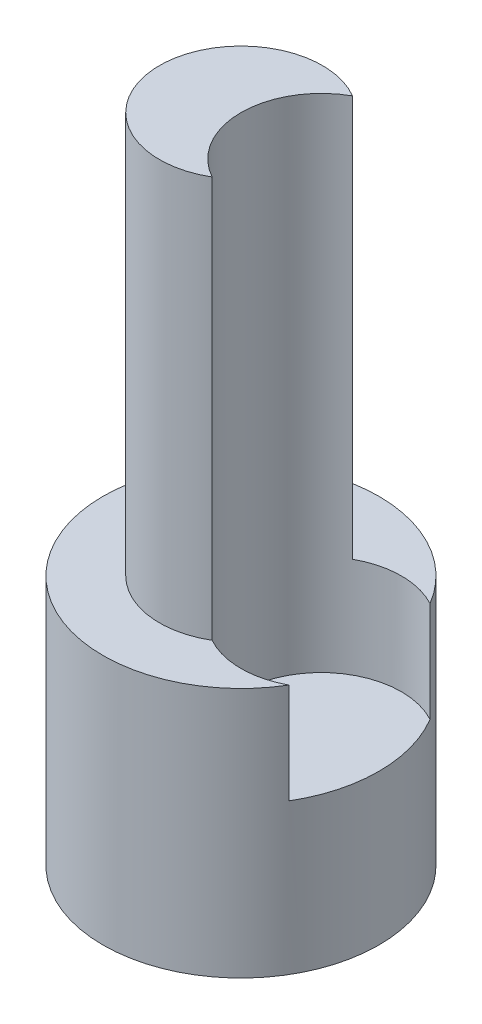
ISO-10303-21;
HEADER;
FILE_DESCRIPTION(('STEP AP214'),'2;1');
FILE_NAME('part.step','',(''),(''),'','','');
FILE_SCHEMA(('AUTOMOTIVE_DESIGN { 1 0 10303 214 1 1 1 1 }'));
ENDSEC;
DATA;
#1=APPLICATION_CONTEXT('core data for automotive mechanical design processes');
#2=APPLICATION_PROTOCOL_DEFINITION('international standard','automotive_design',2000,#1);
#3=PRODUCT_CONTEXT('',#1,'mechanical');
#4=PRODUCT('Part','Part','',(#3));
#5=PRODUCT_RELATED_PRODUCT_CATEGORY('part','',(#4));
#6=PRODUCT_DEFINITION_FORMATION('','',#4);
#7=PRODUCT_DEFINITION_CONTEXT('part definition',#1,'design');
#8=PRODUCT_DEFINITION('design','',#6,#7);
#9=PRODUCT_DEFINITION_SHAPE('','',#8);
#10=(LENGTH_UNIT() NAMED_UNIT(*) SI_UNIT(.MILLI.,.METRE.));
#11=(NAMED_UNIT(*) PLANE_ANGLE_UNIT() SI_UNIT($,.RADIAN.));
#12=(NAMED_UNIT(*) SI_UNIT($,.STERADIAN.) SOLID_ANGLE_UNIT());
#13=UNCERTAINTY_MEASURE_WITH_UNIT(LENGTH_MEASURE(1.E-05),#10,'distance_accuracy_value','');
#14=(GEOMETRIC_REPRESENTATION_CONTEXT(3) GLOBAL_UNCERTAINTY_ASSIGNED_CONTEXT((#13)) GLOBAL_UNIT_ASSIGNED_CONTEXT((#10,
#11,#12)) REPRESENTATION_CONTEXT('',''));
#15=CARTESIAN_POINT('',(0.,0.,0.));
#16=DIRECTION('',(0.,0.,1.));
#17=DIRECTION('',(1.,0.,0.));
#18=AXIS2_PLACEMENT_3D('',#15,#16,#17);
#19=CARTESIAN_POINT('',(0.,5.,0.));
#20=DIRECTION('',(0.,-1.,0.));
#21=DIRECTION('',(0.,0.,-1.));
#22=AXIS2_PLACEMENT_3D('',#19,#20,#21);
#23=CYLINDRICAL_SURFACE('',#22,2.75);
#24=CARTESIAN_POINT('',(0.,3.,0.));
#25=DIRECTION('',(0.,1.,0.));
#26=DIRECTION('',(0.,0.,1.));
#27=AXIS2_PLACEMENT_3D('',#24,#25,#26);
#28=CIRCLE('',#27,2.75);
#29=CARTESIAN_POINT('',(2.36328125,3.,1.40620117102726));
#30=VERTEX_POINT('',#29);
#31=CARTESIAN_POINT('',(2.36328125,3.,-1.40620117102726));
#32=VERTEX_POINT('',#31);
#33=EDGE_CURVE('E84',#30,#32,#28,.T.);
#34=ORIENTED_EDGE('',*,*,#33,.F.);
#35=DIRECTION('',(0.,1.,0.));
#36=VECTOR('',#35,1.);
#37=CARTESIAN_POINT('',(2.36328125,3.,1.40620117102726));
#38=LINE('',#37,#36);
#39=CARTESIAN_POINT('',(2.36328125,5.,1.40620117102726));
#40=VERTEX_POINT('',#39);
#41=EDGE_CURVE('E73',#30,#40,#38,.T.);
#42=ORIENTED_EDGE('',*,*,#41,.T.);
#43=CARTESIAN_POINT('',(0.,5.,0.));
#44=DIRECTION('',(0.,1.,0.));
#45=DIRECTION('',(0.,0.,1.));
#46=AXIS2_PLACEMENT_3D('',#43,#44,#45);
#47=CIRCLE('',#46,2.75);
#48=CARTESIAN_POINT('',(2.36328125,5.,-1.40620117102726));
#49=VERTEX_POINT('',#48);
#50=EDGE_CURVE('E44',#49,#40,#47,.T.);
#51=ORIENTED_EDGE('',*,*,#50,.F.);
#52=DIRECTION('',(0.,1.,0.));
#53=VECTOR('',#52,1.);
#54=CARTESIAN_POINT('',(2.36328125,3.,-1.40620117102726));
#55=LINE('',#54,#53);
#56=EDGE_CURVE('E83',#32,#49,#55,.T.);
#57=ORIENTED_EDGE('',*,*,#56,.F.);
#58=EDGE_LOOP('',(#34,#42,#51,#57));
#59=FACE_BOUND('',#58,.T.);
#60=CARTESIAN_POINT('',(0.,0.,0.));
#61=DIRECTION('',(0.,1.,0.));
#62=DIRECTION('',(0.,0.,1.));
#63=AXIS2_PLACEMENT_3D('',#60,#61,#62);
#64=CIRCLE('',#63,2.75);
#65=CARTESIAN_POINT('',(0.,0.,2.75));
#66=VERTEX_POINT('',#65);
#67=EDGE_CURVE('E101',#66,#66,#64,.T.);
#68=ORIENTED_EDGE('',*,*,#67,.T.);
#69=EDGE_LOOP('',(#68));
#70=FACE_BOUND('',#69,.T.);
#71=ADVANCED_FACE('F37',(#59,#70),#23,.T.);
#72=CARTESIAN_POINT('',(0.,5.,0.));
#73=DIRECTION('',(0.,1.,0.));
#74=DIRECTION('',(0.,0.,1.));
#75=AXIS2_PLACEMENT_3D('',#72,#73,#74);
#76=PLANE('',#75);
#77=CARTESIAN_POINT('',(1.6,5.,0.));
#78=DIRECTION('',(0.,1.,0.));
#79=DIRECTION('',(0.,0.,1.));
#80=AXIS2_PLACEMENT_3D('',#77,#78,#79);
#81=CIRCLE('',#80,1.6);
#82=CARTESIAN_POINT('',(0.8251953125,5.,-1.39988488677749));
#83=VERTEX_POINT('',#82);
#84=EDGE_CURVE('E95',#49,#83,#81,.T.);
#85=ORIENTED_EDGE('',*,*,#84,.F.);
#86=ORIENTED_EDGE('',*,*,#50,.T.);
#87=CARTESIAN_POINT('',(0.8251953125,5.,1.39988488677749));
#88=VERTEX_POINT('',#87);
#89=EDGE_CURVE('E78',#88,#40,#81,.T.);
#90=ORIENTED_EDGE('',*,*,#89,.F.);
#91=CARTESIAN_POINT('',(0.,5.,0.));
#92=DIRECTION('',(0.,1.,0.));
#93=DIRECTION('',(0.,0.,1.));
#94=AXIS2_PLACEMENT_3D('',#91,#92,#93);
#95=CIRCLE('',#94,1.625);
#96=EDGE_CURVE('E102',#83,#88,#95,.T.);
#97=ORIENTED_EDGE('',*,*,#96,.F.);
#98=EDGE_LOOP('',(#85,#86,#90,#97));
#99=FACE_BOUND('',#98,.T.);
#100=ADVANCED_FACE('F111',(#99),#76,.T.);
#101=CARTESIAN_POINT('',(0.,0.,0.));
#102=DIRECTION('',(0.,1.,0.));
#103=DIRECTION('',(0.,0.,1.));
#104=AXIS2_PLACEMENT_3D('',#101,#102,#103);
#105=PLANE('',#104);
#106=ORIENTED_EDGE('',*,*,#67,.F.);
#107=EDGE_LOOP('',(#106));
#108=FACE_BOUND('',#107,.T.);
#109=ADVANCED_FACE('F108',(#108),#105,.F.);
#110=CARTESIAN_POINT('',(0.,13.,0.));
#111=DIRECTION('',(0.,-1.,0.));
#112=DIRECTION('',(0.,0.,-1.));
#113=AXIS2_PLACEMENT_3D('',#110,#111,#112);
#114=CYLINDRICAL_SURFACE('',#113,1.625);
#115=ORIENTED_EDGE('',*,*,#96,.T.);
#116=DIRECTION('',(0.,1.,0.));
#117=VECTOR('',#116,1.);
#118=CARTESIAN_POINT('',(0.8251953125,8.,1.39988488677749));
#119=LINE('',#118,#117);
#120=CARTESIAN_POINT('',(0.8251953125,13.,1.39988488677749));
#121=VERTEX_POINT('',#120);
#122=EDGE_CURVE('E56',#88,#121,#119,.T.);
#123=ORIENTED_EDGE('',*,*,#122,.T.);
#124=CARTESIAN_POINT('',(0.,13.,0.));
#125=DIRECTION('',(0.,1.,0.));
#126=DIRECTION('',(0.,0.,1.));
#127=AXIS2_PLACEMENT_3D('',#124,#125,#126);
#128=CIRCLE('',#127,1.625);
#129=CARTESIAN_POINT('',(0.8251953125,13.,-1.39988488677749));
#130=VERTEX_POINT('',#129);
#131=EDGE_CURVE('E98',#130,#121,#128,.T.);
#132=ORIENTED_EDGE('',*,*,#131,.F.);
#133=DIRECTION('',(0.,1.,0.));
#134=VECTOR('',#133,1.);
#135=CARTESIAN_POINT('',(0.8251953125,8.,-1.39988488677749));
#136=LINE('',#135,#134);
#137=EDGE_CURVE('E50',#130,#83,#136,.F.);
#138=ORIENTED_EDGE('',*,*,#137,.T.);
#139=EDGE_LOOP('',(#115,#123,#132,#138));
#140=FACE_BOUND('',#139,.T.);
#141=ADVANCED_FACE('F110',(#140),#114,.T.);
#142=CARTESIAN_POINT('',(0.,13.,0.));
#143=DIRECTION('',(0.,1.,0.));
#144=DIRECTION('',(0.,0.,1.));
#145=AXIS2_PLACEMENT_3D('',#142,#143,#144);
#146=PLANE('',#145);
#147=CARTESIAN_POINT('',(1.6,13.,0.));
#148=DIRECTION('',(0.,1.,0.));
#149=DIRECTION('',(0.,0.,1.));
#150=AXIS2_PLACEMENT_3D('',#147,#148,#149);
#151=CIRCLE('',#150,1.6);
#152=EDGE_CURVE('E11',#130,#121,#151,.T.);
#153=ORIENTED_EDGE('',*,*,#152,.F.);
#154=ORIENTED_EDGE('',*,*,#131,.T.);
#155=EDGE_LOOP('',(#153,#154));
#156=FACE_BOUND('',#155,.T.);
#157=ADVANCED_FACE('F116',(#156),#146,.T.);
#158=CARTESIAN_POINT('',(1.6,3.,0.));
#159=DIRECTION('',(0.,1.,0.));
#160=DIRECTION('',(0.,0.,1.));
#161=AXIS2_PLACEMENT_3D('',#158,#159,#160);
#162=CYLINDRICAL_SURFACE('',#161,1.6);
#163=ORIENTED_EDGE('',*,*,#89,.T.);
#164=ORIENTED_EDGE('',*,*,#41,.F.);
#165=CARTESIAN_POINT('',(1.6,3.,0.));
#166=DIRECTION('',(0.,1.,0.));
#167=DIRECTION('',(0.,0.,1.));
#168=AXIS2_PLACEMENT_3D('',#165,#166,#167);
#169=CIRCLE('',#168,1.6);
#170=EDGE_CURVE('E76',#32,#30,#169,.T.);
#171=ORIENTED_EDGE('',*,*,#170,.F.);
#172=ORIENTED_EDGE('',*,*,#56,.T.);
#173=ORIENTED_EDGE('',*,*,#84,.T.);
#174=ORIENTED_EDGE('',*,*,#137,.F.);
#175=ORIENTED_EDGE('',*,*,#152,.T.);
#176=ORIENTED_EDGE('',*,*,#122,.F.);
#177=EDGE_LOOP('',(#163,#164,#171,#172,#173,#174,#175,#176));
#178=FACE_BOUND('',#177,.T.);
#179=ADVANCED_FACE('F75',(#178),#162,.F.);
#180=CARTESIAN_POINT('',(0.8,3.,0.));
#181=DIRECTION('',(0.,1.,0.));
#182=DIRECTION('',(0.,0.,1.));
#183=AXIS2_PLACEMENT_3D('',#180,#181,#182);
#184=PLANE('',#183);
#185=ORIENTED_EDGE('',*,*,#170,.T.);
#186=ORIENTED_EDGE('',*,*,#33,.T.);
#187=EDGE_LOOP('',(#185,#186));
#188=FACE_BOUND('',#187,.T.);
#189=ADVANCED_FACE('F87',(#188),#184,.T.);
#190=CLOSED_SHELL('',(#71,#100,#109,#141,#157,#179,#189));
#191=MANIFOLD_SOLID_BREP('B2',#190);
#192=ADVANCED_BREP_SHAPE_REPRESENTATION('',(#18,#191),#14);
#193=SHAPE_DEFINITION_REPRESENTATION(#9,#192);
ENDSEC;
END-ISO-10303-21;
